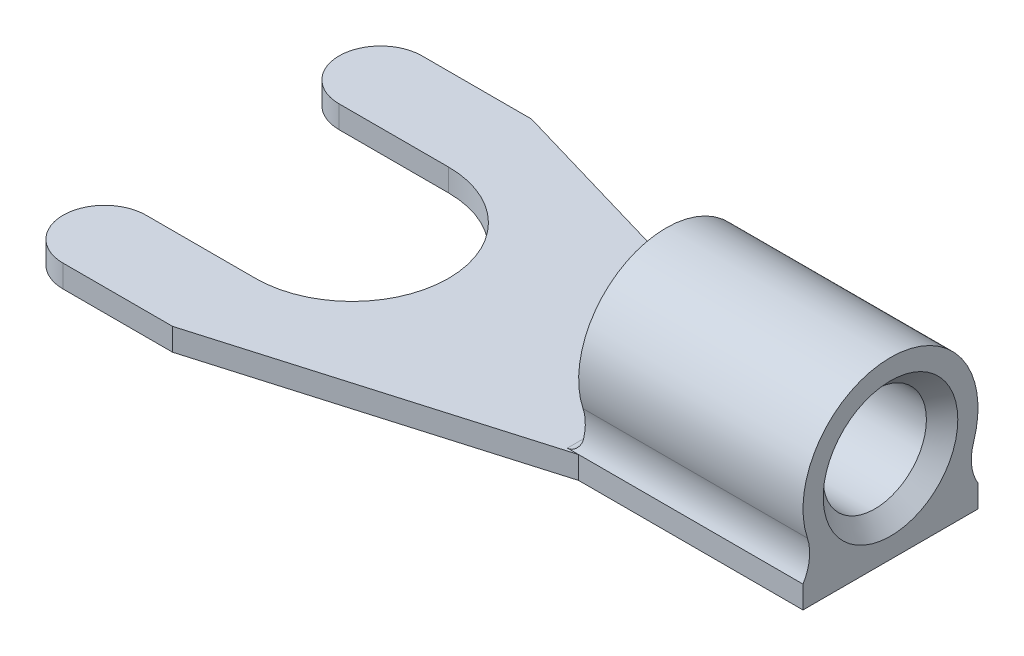
ISO-10303-21;
HEADER;
FILE_DESCRIPTION(('STEP AP214'),'2;1');
FILE_NAME('part.step','',(''),(''),'','','');
FILE_SCHEMA(('AUTOMOTIVE_DESIGN { 1 0 10303 214 1 1 1 1 }'));
ENDSEC;
DATA;
#1=APPLICATION_CONTEXT('core data for automotive mechanical design processes');
#2=APPLICATION_PROTOCOL_DEFINITION('international standard','automotive_design',2000,#1);
#3=PRODUCT_CONTEXT('',#1,'mechanical');
#4=PRODUCT('Part','Part','',(#3));
#5=PRODUCT_RELATED_PRODUCT_CATEGORY('part','',(#4));
#6=PRODUCT_DEFINITION_FORMATION('','',#4);
#7=PRODUCT_DEFINITION_CONTEXT('part definition',#1,'design');
#8=PRODUCT_DEFINITION('design','',#6,#7);
#9=PRODUCT_DEFINITION_SHAPE('','',#8);
#10=(LENGTH_UNIT() NAMED_UNIT(*) SI_UNIT(.MILLI.,.METRE.));
#11=(NAMED_UNIT(*) PLANE_ANGLE_UNIT() SI_UNIT($,.RADIAN.));
#12=(NAMED_UNIT(*) SI_UNIT($,.STERADIAN.) SOLID_ANGLE_UNIT());
#13=UNCERTAINTY_MEASURE_WITH_UNIT(LENGTH_MEASURE(1.E-05),#10,'distance_accuracy_value','');
#14=(GEOMETRIC_REPRESENTATION_CONTEXT(3) GLOBAL_UNCERTAINTY_ASSIGNED_CONTEXT((#13)) GLOBAL_UNIT_ASSIGNED_CONTEXT((#10,
#11,#12)) REPRESENTATION_CONTEXT('',''));
#15=CARTESIAN_POINT('',(0.,0.,0.));
#16=DIRECTION('',(0.,0.,1.));
#17=DIRECTION('',(1.,0.,0.));
#18=AXIS2_PLACEMENT_3D('',#15,#16,#17);
#19=CARTESIAN_POINT('',(6.75,0.75,0.));
#20=DIRECTION('',(0.,0.,-1.));
#21=DIRECTION('',(-1.,0.,0.));
#22=AXIS2_PLACEMENT_3D('',#19,#20,#21);
#23=CYLINDRICAL_SURFACE('',#22,0.25);
#24=DIRECTION('',(0.,0.,-1.));
#25=VECTOR('',#24,1.);
#26=CARTESIAN_POINT('',(7.,0.75,0.));
#27=LINE('',#26,#25);
#28=CARTESIAN_POINT('',(7.,0.75,1.83970172769144));
#29=VERTEX_POINT('',#28);
#30=CARTESIAN_POINT('',(7.,0.75,-1.83970172769145));
#31=VERTEX_POINT('',#30);
#32=EDGE_CURVE('E135',#29,#31,#27,.T.);
#33=ORIENTED_EDGE('',*,*,#32,.T.);
#34=CARTESIAN_POINT('',(6.75,0.5,-1.95));
#35=CARTESIAN_POINT('',(6.76279265219974,0.49998350208187,-1.95001852201698));
#36=CARTESIAN_POINT('',(6.7755633057261,0.500980599796446,-1.94939519772531));
#37=CARTESIAN_POINT('',(6.80063546863913,0.504859731445587,-1.94701727306771));
#38=CARTESIAN_POINT('',(6.81293922839229,0.507731040580708,-1.94526911017123));
#39=CARTESIAN_POINT('',(6.83678560324556,0.515212911902467,-1.94079455531296));
#40=CARTESIAN_POINT('',(6.84832945788207,0.519820554876355,-1.93806980561242));
#41=CARTESIAN_POINT('',(6.870457868658,0.530588402063698,-1.9318583154222));
#42=CARTESIAN_POINT('',(6.88104113706603,0.536750649720279,-1.92837057282786));
#43=CARTESIAN_POINT('',(6.90182686819083,0.550955109626043,-1.92057204094232));
#44=CARTESIAN_POINT('',(6.91194019338923,0.559104161345929,-1.91621898373589));
#45=CARTESIAN_POINT('',(6.93070840237227,0.576764076820902,-1.90714700315842));
#46=CARTESIAN_POINT('',(6.93936258007138,0.586275595783677,-1.90242790426221));
#47=CARTESIAN_POINT('',(6.95610042568564,0.607764133345738,-1.89223760604453));
#48=CARTESIAN_POINT('',(6.96396839551215,0.619900907889746,-1.88674760040437));
#49=CARTESIAN_POINT('',(6.97751486064914,0.645381102194384,-1.87588282433389));
#50=CARTESIAN_POINT('',(6.98319426201095,0.65872401979007,-1.87050800708861));
#51=CARTESIAN_POINT('',(6.99171759524682,0.684875563743601,-1.86066348131627));
#52=CARTESIAN_POINT('',(6.99479581212117,0.697594317014776,-1.85615788313342));
#53=CARTESIAN_POINT('',(6.99894022470101,0.723508733763793,-1.84757298169228));
#54=CARTESIAN_POINT('',(7.00000420944867,0.736704905121006,-1.84349415151592));
#55=CARTESIAN_POINT('',(7.,0.75,-1.83970172769145));
#56=B_SPLINE_CURVE_WITH_KNOTS('',3,(#34,#35,#36,#37,#38,#39,#40,#41,#42,#43,#44,#45,#46,#47,#48,
#49,#50,#51,#52,#53,#54,#55),.UNSPECIFIED.,.F.,.F.,(4,2,2,2,2,2,2,2,2,2,4),(0.,
0.0382893069018886,0.0763614093332972,0.114369786533511,0.152428386377301,0.193361552979276,
0.234314470757137,0.280522325949254,0.326711030823096,0.368073046255097,0.409480437175454),.UNSPECIFIED.);
#57=CARTESIAN_POINT('',(6.75,0.5,-1.95));
#58=VERTEX_POINT('',#57);
#59=EDGE_CURVE('E20',#58,#31,#56,.T.);
#60=ORIENTED_EDGE('',*,*,#59,.F.);
#61=DIRECTION('',(0.,0.,1.));
#62=VECTOR('',#61,1.);
#63=CARTESIAN_POINT('',(6.75,0.5,0.));
#64=LINE('',#63,#62);
#65=CARTESIAN_POINT('',(6.75,0.5,1.95));
#66=VERTEX_POINT('',#65);
#67=EDGE_CURVE('E132',#66,#58,#64,.F.);
#68=ORIENTED_EDGE('',*,*,#67,.F.);
#69=CARTESIAN_POINT('',(7.,0.75,1.83970172769144));
#70=CARTESIAN_POINT('',(7.000006521075,0.735127796790294,1.84394032011878));
#71=CARTESIAN_POINT('',(6.99867427441531,0.720382659943751,1.84854137054598));
#72=CARTESIAN_POINT('',(6.99350891013348,0.691550767285415,1.8582501300237));
#73=CARTESIAN_POINT('',(6.98968232860374,0.677462393603863,1.86335648540662));
#74=CARTESIAN_POINT('',(6.97970942661208,0.650283784135015,1.87387530595083));
#75=CARTESIAN_POINT('',(6.97356600432858,0.637192325778406,1.87928738151938));
#76=CARTESIAN_POINT('',(6.95913179602968,0.612263039792255,1.89017218669945));
#77=CARTESIAN_POINT('',(6.95083905655132,0.600426366468528,1.8956449671302));
#78=CARTESIAN_POINT('',(6.93190778527895,0.577851412965472,1.9065665800011));
#79=CARTESIAN_POINT('',(6.92118933448232,0.567175227082837,1.9120058737872));
#80=CARTESIAN_POINT('',(6.89781213081132,0.547807805392044,1.92224466813309));
#81=CARTESIAN_POINT('',(6.88515348283173,0.539116462338589,1.92704420325457));
#82=CARTESIAN_POINT('',(6.85882494158289,0.524449038300311,1.93536105133942));
#83=CARTESIAN_POINT('',(6.84523320827134,0.518362266308088,1.93892902019162));
#84=CARTESIAN_POINT('',(6.81693782547046,0.508667793434214,1.9446966990955));
#85=CARTESIAN_POINT('',(6.80223768054368,0.505052615028265,1.94690053424634));
#86=CARTESIAN_POINT('',(6.78112626789295,0.501866510936535,1.94885133002611));
#87=CARTESIAN_POINT('',(6.7749289859734,0.501167615441771,1.94928088909551));
#88=CARTESIAN_POINT('',(6.76248923138757,0.500234473310872,1.94985533198226));
#89=CARTESIAN_POINT('',(6.75624677974096,0.500000022951555,1.95000034061393));
#90=CARTESIAN_POINT('',(6.75,0.5,1.95));
#91=B_SPLINE_CURVE_WITH_KNOTS('',3,(#69,#70,#71,#72,#73,#74,#75,#76,#77,#78,#79,#80,#81,#82,#83,
#84,#85,#86,#87,#88,#89,#90),.UNSPECIFIED.,.F.,.F.,(4,2,2,2,2,2,2,2,2,2,4),(0.,
0.0462989373863092,0.0924770392758406,0.138597566715203,0.18476015989697,0.232751610935631,
0.280740468279867,0.326416072227268,0.371952870974995,0.390686940772955,0.409412791278968),.UNSPECIFIED.);
#92=EDGE_CURVE('E140',#29,#66,#91,.T.);
#93=ORIENTED_EDGE('',*,*,#92,.F.);
#94=EDGE_LOOP('',(#33,#60,#68,#93));
#95=FACE_BOUND('',#94,.T.);
#96=ADVANCED_FACE('F16',(#95),#23,.F.);
#97=CARTESIAN_POINT('',(7.,1.95,0.));
#98=DIRECTION('',(1.,0.,0.));
#99=DIRECTION('',(0.,0.,-1.));
#100=AXIS2_PLACEMENT_3D('',#97,#98,#99);
#101=CYLINDRICAL_SURFACE('',#100,1.15);
#102=CARTESIAN_POINT('',(11.6499999999746,1.95,0.));
#103=DIRECTION('',(1.,0.,0.));
#104=DIRECTION('',(0.,0.,-1.));
#105=AXIS2_PLACEMENT_3D('',#102,#103,#104);
#106=CIRCLE('',#105,1.14999999999554);
#107=CARTESIAN_POINT('',(11.6499999999746,1.95,-1.14999999999554));
#108=VERTEX_POINT('',#107);
#109=EDGE_CURVE('E224',#108,#108,#106,.T.);
#110=ORIENTED_EDGE('',*,*,#109,.T.);
#111=EDGE_LOOP('',(#110));
#112=FACE_BOUND('',#111,.T.);
#113=CARTESIAN_POINT('',(7.,1.95,0.));
#114=DIRECTION('',(1.,0.,0.));
#115=DIRECTION('',(0.,0.,-1.));
#116=AXIS2_PLACEMENT_3D('',#113,#114,#115);
#117=CIRCLE('',#116,1.15);
#118=CARTESIAN_POINT('',(7.,1.95,-1.15));
#119=VERTEX_POINT('',#118);
#120=EDGE_CURVE('E150',#119,#119,#117,.F.);
#121=ORIENTED_EDGE('',*,*,#120,.T.);
#122=EDGE_LOOP('',(#121));
#123=FACE_BOUND('',#122,.T.);
#124=ADVANCED_FACE('F277',(#112,#123),#101,.F.);
#125=CARTESIAN_POINT('',(7.,1.95,0.));
#126=DIRECTION('',(1.,0.,0.));
#127=DIRECTION('',(0.,0.,-1.));
#128=AXIS2_PLACEMENT_3D('',#125,#126,#127);
#129=PLANE('',#128);
#130=ORIENTED_EDGE('',*,*,#120,.F.);
#131=EDGE_LOOP('',(#130));
#132=FACE_BOUND('',#131,.T.);
#133=ORIENTED_EDGE('',*,*,#32,.F.);
#134=CARTESIAN_POINT('',(7.,1.02486780796408,2.80118375463996));
#135=DIRECTION('',(-1.,0.,0.));
#136=DIRECTION('',(0.,0.,1.));
#137=AXIS2_PLACEMENT_3D('',#134,#135,#136);
#138=CIRCLE('',#137,1.);
#139=CARTESIAN_POINT('',(7.,1.33847194085761,1.85162993950777));
#140=VERTEX_POINT('',#139);
#141=EDGE_CURVE('E191',#29,#140,#138,.F.);
#142=ORIENTED_EDGE('',*,*,#141,.T.);
#143=CARTESIAN_POINT('',(7.,1.95,0.));
#144=DIRECTION('',(1.,0.,0.));
#145=DIRECTION('',(0.,0.,-1.));
#146=AXIS2_PLACEMENT_3D('',#143,#144,#145);
#147=CIRCLE('',#146,1.95);
#148=CARTESIAN_POINT('',(7.,1.33847194085761,-1.85162993950777));
#149=VERTEX_POINT('',#148);
#150=EDGE_CURVE('E161',#149,#140,#147,.T.);
#151=ORIENTED_EDGE('',*,*,#150,.F.);
#152=CARTESIAN_POINT('',(7.,1.02486780796408,-2.80118375463996));
#153=DIRECTION('',(1.,0.,0.));
#154=DIRECTION('',(0.,0.,-1.));
#155=AXIS2_PLACEMENT_3D('',#152,#153,#154);
#156=CIRCLE('',#155,1.);
#157=EDGE_CURVE('E223',#31,#149,#156,.F.);
#158=ORIENTED_EDGE('',*,*,#157,.F.);
#159=EDGE_LOOP('',(#133,#142,#151,#158));
#160=FACE_BOUND('',#159,.T.);
#161=ADVANCED_FACE('F275',(#132,#160),#129,.F.);
#162=CARTESIAN_POINT('',(0.,0.5,0.));
#163=DIRECTION('',(0.,1.,0.));
#164=DIRECTION('',(0.,0.,1.));
#165=AXIS2_PLACEMENT_3D('',#162,#163,#164);
#166=PLANE('',#165);
#167=DIRECTION('',(-0.959692321040619,0.,0.281052751161895));
#168=VECTOR('',#167,1.);
#169=CARTESIAN_POINT('',(1.07889666838964,0.5,3.68403740425732));
#170=LINE('',#169,#168);
#171=CARTESIAN_POINT('',(0.,0.5,4.));
#172=VERTEX_POINT('',#171);
#173=CARTESIAN_POINT('',(7.,0.5,1.95));
#174=VERTEX_POINT('',#173);
#175=EDGE_CURVE('E197',#172,#174,#170,.F.);
#176=ORIENTED_EDGE('',*,*,#175,.T.);
#177=DIRECTION('',(-1.,0.,0.));
#178=VECTOR('',#177,1.);
#179=CARTESIAN_POINT('',(0.,0.499999999999999,1.95));
#180=LINE('',#179,#178);
#181=EDGE_CURVE('E148',#174,#66,#180,.T.);
#182=ORIENTED_EDGE('',*,*,#181,.T.);
#183=ORIENTED_EDGE('',*,*,#67,.T.);
#184=DIRECTION('',(1.,0.,0.));
#185=VECTOR('',#184,1.);
#186=CARTESIAN_POINT('',(0.,0.5,-1.95));
#187=LINE('',#186,#185);
#188=CARTESIAN_POINT('',(7.,0.5,-1.95));
#189=VERTEX_POINT('',#188);
#190=EDGE_CURVE('E146',#58,#189,#187,.T.);
#191=ORIENTED_EDGE('',*,*,#190,.T.);
#192=DIRECTION('',(0.959692321040619,0.,0.281052751161895));
#193=VECTOR('',#192,1.);
#194=CARTESIAN_POINT('',(1.07889666838964,0.5,-3.68403740425732));
#195=LINE('',#194,#193);
#196=CARTESIAN_POINT('',(0.,0.5,-4.));
#197=VERTEX_POINT('',#196);
#198=EDGE_CURVE('E155',#189,#197,#195,.F.);
#199=ORIENTED_EDGE('',*,*,#198,.T.);
#200=DIRECTION('',(-1.,0.,0.));
#201=VECTOR('',#200,1.);
#202=CARTESIAN_POINT('',(0.,0.5,-4.));
#203=LINE('',#202,#201);
#204=CARTESIAN_POINT('',(-2.43926218353009,0.5,-4.));
#205=VERTEX_POINT('',#204);
#206=EDGE_CURVE('E158',#205,#197,#203,.F.);
#207=ORIENTED_EDGE('',*,*,#206,.F.);
#208=CARTESIAN_POINT('',(-2.43926218353009,0.5,-3.075));
#209=DIRECTION('',(0.,-1.,0.));
#210=DIRECTION('',(0.,0.,-1.));
#211=AXIS2_PLACEMENT_3D('',#208,#209,#210);
#212=CIRCLE('',#211,0.925);
#213=CARTESIAN_POINT('',(-2.43926218353009,0.5,-2.15));
#214=VERTEX_POINT('',#213);
#215=EDGE_CURVE('E253',#214,#205,#212,.T.);
#216=ORIENTED_EDGE('',*,*,#215,.F.);
#217=DIRECTION('',(1.,0.,0.));
#218=VECTOR('',#217,1.);
#219=CARTESIAN_POINT('',(0.,0.5,-2.15));
#220=LINE('',#219,#218);
#221=CARTESIAN_POINT('',(0.,0.5,-2.15));
#222=VERTEX_POINT('',#221);
#223=EDGE_CURVE('E214',#222,#214,#220,.F.);
#224=ORIENTED_EDGE('',*,*,#223,.F.);
#225=CARTESIAN_POINT('',(0.,0.5,0.));
#226=DIRECTION('',(0.,-1.,0.));
#227=DIRECTION('',(0.,0.,-1.));
#228=AXIS2_PLACEMENT_3D('',#225,#226,#227);
#229=CIRCLE('',#228,2.15);
#230=CARTESIAN_POINT('',(0.,0.5,2.15));
#231=VERTEX_POINT('',#230);
#232=EDGE_CURVE('E250',#222,#231,#229,.T.);
#233=ORIENTED_EDGE('',*,*,#232,.T.);
#234=DIRECTION('',(1.,0.,0.));
#235=VECTOR('',#234,1.);
#236=CARTESIAN_POINT('',(0.,0.5,2.15));
#237=LINE('',#236,#235);
#238=CARTESIAN_POINT('',(-2.43926218353009,0.5,2.15));
#239=VERTEX_POINT('',#238);
#240=EDGE_CURVE('E209',#231,#239,#237,.F.);
#241=ORIENTED_EDGE('',*,*,#240,.T.);
#242=CARTESIAN_POINT('',(-2.43926218353009,0.5,3.075));
#243=DIRECTION('',(0.,-1.,0.));
#244=DIRECTION('',(0.,0.,-1.));
#245=AXIS2_PLACEMENT_3D('',#242,#243,#244);
#246=CIRCLE('',#245,0.925);
#247=CARTESIAN_POINT('',(-2.43926218353009,0.5,4.));
#248=VERTEX_POINT('',#247);
#249=EDGE_CURVE('E212',#248,#239,#246,.T.);
#250=ORIENTED_EDGE('',*,*,#249,.F.);
#251=DIRECTION('',(-1.,0.,0.));
#252=VECTOR('',#251,1.);
#253=CARTESIAN_POINT('',(0.,0.5,4.));
#254=LINE('',#253,#252);
#255=EDGE_CURVE('E204',#248,#172,#254,.F.);
#256=ORIENTED_EDGE('',*,*,#255,.T.);
#257=EDGE_LOOP('',(#176,#182,#183,#191,#199,#207,#216,#224,#233,#241,#250,#256));
#258=FACE_BOUND('',#257,.T.);
#259=ADVANCED_FACE('F144',(#258),#166,.T.);
#260=CARTESIAN_POINT('',(0.,1.02486780796408,2.80118375463996));
#261=DIRECTION('',(-1.,0.,0.));
#262=DIRECTION('',(0.,0.,1.));
#263=AXIS2_PLACEMENT_3D('',#260,#261,#262);
#264=CYLINDRICAL_SURFACE('',#263,1.);
#265=ORIENTED_EDGE('',*,*,#92,.T.);
#266=ORIENTED_EDGE('',*,*,#181,.F.);
#267=DIRECTION('',(-1.,0.,0.));
#268=VECTOR('',#267,1.);
#269=CARTESIAN_POINT('',(0.,0.5,1.95));
#270=LINE('',#269,#268);
#271=CARTESIAN_POINT('',(12.,0.499999999999997,1.95));
#272=VERTEX_POINT('',#271);
#273=EDGE_CURVE('E178',#174,#272,#270,.F.);
#274=ORIENTED_EDGE('',*,*,#273,.T.);
#275=CARTESIAN_POINT('',(12.,1.02486780796408,2.80118375463996));
#276=DIRECTION('',(-1.,0.,0.));
#277=DIRECTION('',(0.,0.,1.));
#278=AXIS2_PLACEMENT_3D('',#275,#276,#277);
#279=CIRCLE('',#278,1.);
#280=CARTESIAN_POINT('',(12.,1.33847194085761,1.85162993950777));
#281=VERTEX_POINT('',#280);
#282=EDGE_CURVE('E192',#281,#272,#279,.T.);
#283=ORIENTED_EDGE('',*,*,#282,.F.);
#284=DIRECTION('',(-1.,0.,0.));
#285=VECTOR('',#284,1.);
#286=CARTESIAN_POINT('',(0.,1.33847194085761,1.85162993950777));
#287=LINE('',#286,#285);
#288=EDGE_CURVE('E149',#140,#281,#287,.F.);
#289=ORIENTED_EDGE('',*,*,#288,.F.);
#290=ORIENTED_EDGE('',*,*,#141,.F.);
#291=EDGE_LOOP('',(#265,#266,#274,#283,#289,#290));
#292=FACE_BOUND('',#291,.T.);
#293=ADVANCED_FACE('F265',(#292),#264,.F.);
#294=CARTESIAN_POINT('',(11.9999999999436,1.95,0.));
#295=DIRECTION('',(1.,0.,0.));
#296=DIRECTION('',(0.,0.,-1.));
#297=AXIS2_PLACEMENT_3D('',#294,#295,#296);
#298=CONICAL_SURFACE('',#297,1.49999999996453,0.785398163397448);
#299=CARTESIAN_POINT('',(12.0000000000005,1.95,0.));
#300=DIRECTION('',(1.,0.,0.));
#301=DIRECTION('',(0.,0.,-1.));
#302=AXIS2_PLACEMENT_3D('',#299,#300,#301);
#303=CIRCLE('',#302,1.50000000002137);
#304=CARTESIAN_POINT('',(12.0000000000005,1.95,-1.50000000002137));
#305=VERTEX_POINT('',#304);
#306=EDGE_CURVE('E181',#305,#305,#303,.T.);
#307=ORIENTED_EDGE('',*,*,#306,.T.);
#308=EDGE_LOOP('',(#307));
#309=FACE_BOUND('',#308,.T.);
#310=ORIENTED_EDGE('',*,*,#109,.F.);
#311=EDGE_LOOP('',(#310));
#312=FACE_BOUND('',#311,.T.);
#313=ADVANCED_FACE('F270',(#309,#312),#298,.F.);
#314=CARTESIAN_POINT('',(7.,1.95,0.));
#315=DIRECTION('',(1.,0.,0.));
#316=DIRECTION('',(0.,0.,-1.));
#317=AXIS2_PLACEMENT_3D('',#314,#315,#316);
#318=CYLINDRICAL_SURFACE('',#317,1.95);
#319=CARTESIAN_POINT('',(12.,1.95,0.));
#320=DIRECTION('',(1.,0.,0.));
#321=DIRECTION('',(0.,0.,-1.));
#322=AXIS2_PLACEMENT_3D('',#319,#320,#321);
#323=CIRCLE('',#322,1.95);
#324=CARTESIAN_POINT('',(12.,1.33847194085761,-1.85162993950777));
#325=VERTEX_POINT('',#324);
#326=EDGE_CURVE('E243',#281,#325,#323,.F.);
#327=ORIENTED_EDGE('',*,*,#326,.T.);
#328=DIRECTION('',(1.,0.,0.));
#329=VECTOR('',#328,1.);
#330=CARTESIAN_POINT('',(0.,1.33847194085761,-1.85162993950777));
#331=LINE('',#330,#329);
#332=EDGE_CURVE('E156',#325,#149,#331,.F.);
#333=ORIENTED_EDGE('',*,*,#332,.T.);
#334=ORIENTED_EDGE('',*,*,#150,.T.);
#335=ORIENTED_EDGE('',*,*,#288,.T.);
#336=EDGE_LOOP('',(#327,#333,#334,#335));
#337=FACE_BOUND('',#336,.T.);
#338=ADVANCED_FACE('F342',(#337),#318,.T.);
#339=CARTESIAN_POINT('',(0.,1.02486780796408,-2.80118375463996));
#340=DIRECTION('',(1.,0.,0.));
#341=DIRECTION('',(0.,0.,-1.));
#342=AXIS2_PLACEMENT_3D('',#339,#340,#341);
#343=CYLINDRICAL_SURFACE('',#342,1.);
#344=DIRECTION('',(1.,0.,0.));
#345=VECTOR('',#344,1.);
#346=CARTESIAN_POINT('',(0.,0.5,-1.95));
#347=LINE('',#346,#345);
#348=CARTESIAN_POINT('',(12.,0.499999999999999,-1.95));
#349=VERTEX_POINT('',#348);
#350=EDGE_CURVE('E154',#349,#189,#347,.F.);
#351=ORIENTED_EDGE('',*,*,#350,.T.);
#352=ORIENTED_EDGE('',*,*,#190,.F.);
#353=ORIENTED_EDGE('',*,*,#59,.T.);
#354=ORIENTED_EDGE('',*,*,#157,.T.);
#355=ORIENTED_EDGE('',*,*,#332,.F.);
#356=CARTESIAN_POINT('',(12.,1.02486780796408,-2.80118375463996));
#357=DIRECTION('',(1.,0.,0.));
#358=DIRECTION('',(0.,0.,-1.));
#359=AXIS2_PLACEMENT_3D('',#356,#357,#358);
#360=CIRCLE('',#359,1.);
#361=EDGE_CURVE('E170',#325,#349,#360,.T.);
#362=ORIENTED_EDGE('',*,*,#361,.T.);
#363=EDGE_LOOP('',(#351,#352,#353,#354,#355,#362));
#364=FACE_BOUND('',#363,.T.);
#365=ADVANCED_FACE('F153',(#364),#343,.F.);
#366=CARTESIAN_POINT('',(1.07889666838964,0.5,-3.68403740425732));
#367=DIRECTION('',(-0.281052751161895,0.,0.959692321040619));
#368=DIRECTION('',(0.959692321040619,0.,0.281052751161895));
#369=AXIS2_PLACEMENT_3D('',#366,#367,#368);
#370=PLANE('',#369);
#371=DIRECTION('',(0.,1.,0.));
#372=VECTOR('',#371,1.);
#373=CARTESIAN_POINT('',(0.,0.5,-4.));
#374=LINE('',#373,#372);
#375=CARTESIAN_POINT('',(0.,0.,-4.));
#376=VERTEX_POINT('',#375);
#377=EDGE_CURVE('E219',#197,#376,#374,.F.);
#378=ORIENTED_EDGE('',*,*,#377,.F.);
#379=ORIENTED_EDGE('',*,*,#198,.F.);
#380=DIRECTION('',(0.,1.,0.));
#381=VECTOR('',#380,1.);
#382=CARTESIAN_POINT('',(7.,0.5,-1.95));
#383=LINE('',#382,#381);
#384=CARTESIAN_POINT('',(7.,0.,-1.95));
#385=VERTEX_POINT('',#384);
#386=EDGE_CURVE('E387',#189,#385,#383,.F.);
#387=ORIENTED_EDGE('',*,*,#386,.T.);
#388=DIRECTION('',(-0.959692321040619,0.,-0.281052751161895));
#389=VECTOR('',#388,1.);
#390=CARTESIAN_POINT('',(7.,0.,-1.95));
#391=LINE('',#390,#389);
#392=EDGE_CURVE('E384',#385,#376,#391,.T.);
#393=ORIENTED_EDGE('',*,*,#392,.T.);
#394=EDGE_LOOP('',(#378,#379,#387,#393));
#395=FACE_BOUND('',#394,.T.);
#396=ADVANCED_FACE('F336',(#395),#370,.F.);
#397=CARTESIAN_POINT('',(0.,0.5,-4.));
#398=DIRECTION('',(0.,0.,-1.));
#399=DIRECTION('',(-1.,0.,0.));
#400=AXIS2_PLACEMENT_3D('',#397,#398,#399);
#401=PLANE('',#400);
#402=ORIENTED_EDGE('',*,*,#206,.T.);
#403=ORIENTED_EDGE('',*,*,#377,.T.);
#404=DIRECTION('',(1.,0.,0.));
#405=VECTOR('',#404,1.);
#406=CARTESIAN_POINT('',(0.,0.,-4.));
#407=LINE('',#406,#405);
#408=CARTESIAN_POINT('',(-2.43926218353009,0.,-4.));
#409=VERTEX_POINT('',#408);
#410=EDGE_CURVE('E241',#376,#409,#407,.F.);
#411=ORIENTED_EDGE('',*,*,#410,.T.);
#412=DIRECTION('',(0.,-1.,0.));
#413=VECTOR('',#412,1.);
#414=CARTESIAN_POINT('',(-2.43926218353009,0.5,-4.));
#415=LINE('',#414,#413);
#416=EDGE_CURVE('E217',#205,#409,#415,.T.);
#417=ORIENTED_EDGE('',*,*,#416,.F.);
#418=EDGE_LOOP('',(#402,#403,#411,#417));
#419=FACE_BOUND('',#418,.T.);
#420=ADVANCED_FACE('F332',(#419),#401,.T.);
#421=CARTESIAN_POINT('',(-2.43926218353009,0.5,-3.075));
#422=DIRECTION('',(0.,-1.,0.));
#423=DIRECTION('',(0.,0.,-1.));
#424=AXIS2_PLACEMENT_3D('',#421,#422,#423);
#425=CYLINDRICAL_SURFACE('',#424,0.925);
#426=ORIENTED_EDGE('',*,*,#215,.T.);
#427=ORIENTED_EDGE('',*,*,#416,.T.);
#428=CARTESIAN_POINT('',(-2.43926218353009,0.,-3.075));
#429=DIRECTION('',(0.,-1.,0.));
#430=DIRECTION('',(0.,0.,-1.));
#431=AXIS2_PLACEMENT_3D('',#428,#429,#430);
#432=CIRCLE('',#431,0.925);
#433=CARTESIAN_POINT('',(-2.43926218353009,0.,-2.15));
#434=VERTEX_POINT('',#433);
#435=EDGE_CURVE('E238',#409,#434,#432,.F.);
#436=ORIENTED_EDGE('',*,*,#435,.T.);
#437=DIRECTION('',(0.,1.,0.));
#438=VECTOR('',#437,1.);
#439=CARTESIAN_POINT('',(-2.43926218353009,0.5,-2.15));
#440=LINE('',#439,#438);
#441=EDGE_CURVE('E216',#214,#434,#440,.F.);
#442=ORIENTED_EDGE('',*,*,#441,.F.);
#443=EDGE_LOOP('',(#426,#427,#436,#442));
#444=FACE_BOUND('',#443,.T.);
#445=ADVANCED_FACE('F328',(#444),#425,.T.);
#446=CARTESIAN_POINT('',(0.,0.5,-2.15));
#447=DIRECTION('',(0.,0.,1.));
#448=DIRECTION('',(1.,0.,0.));
#449=AXIS2_PLACEMENT_3D('',#446,#447,#448);
#450=PLANE('',#449);
#451=ORIENTED_EDGE('',*,*,#223,.T.);
#452=ORIENTED_EDGE('',*,*,#441,.T.);
#453=DIRECTION('',(1.,0.,0.));
#454=VECTOR('',#453,1.);
#455=CARTESIAN_POINT('',(0.,0.,-2.15));
#456=LINE('',#455,#454);
#457=CARTESIAN_POINT('',(0.,0.,-2.15));
#458=VERTEX_POINT('',#457);
#459=EDGE_CURVE('E237',#434,#458,#456,.T.);
#460=ORIENTED_EDGE('',*,*,#459,.T.);
#461=DIRECTION('',(0.,-1.,0.));
#462=VECTOR('',#461,1.);
#463=CARTESIAN_POINT('',(0.,0.5,-2.15));
#464=LINE('',#463,#462);
#465=EDGE_CURVE('E252',#458,#222,#464,.F.);
#466=ORIENTED_EDGE('',*,*,#465,.T.);
#467=EDGE_LOOP('',(#451,#452,#460,#466));
#468=FACE_BOUND('',#467,.T.);
#469=ADVANCED_FACE('F324',(#468),#450,.T.);
#470=CARTESIAN_POINT('',(0.,0.5,0.));
#471=DIRECTION('',(0.,-1.,0.));
#472=DIRECTION('',(0.,0.,-1.));
#473=AXIS2_PLACEMENT_3D('',#470,#471,#472);
#474=CYLINDRICAL_SURFACE('',#473,2.15);
#475=DIRECTION('',(0.,1.,0.));
#476=VECTOR('',#475,1.);
#477=CARTESIAN_POINT('',(0.,0.5,2.15));
#478=LINE('',#477,#476);
#479=CARTESIAN_POINT('',(0.,0.,2.15));
#480=VERTEX_POINT('',#479);
#481=EDGE_CURVE('E213',#480,#231,#478,.T.);
#482=ORIENTED_EDGE('',*,*,#481,.T.);
#483=ORIENTED_EDGE('',*,*,#232,.F.);
#484=ORIENTED_EDGE('',*,*,#465,.F.);
#485=CARTESIAN_POINT('',(0.,0.,0.));
#486=DIRECTION('',(0.,-1.,0.));
#487=DIRECTION('',(0.,0.,-1.));
#488=AXIS2_PLACEMENT_3D('',#485,#486,#487);
#489=CIRCLE('',#488,2.15);
#490=EDGE_CURVE('E234',#458,#480,#489,.T.);
#491=ORIENTED_EDGE('',*,*,#490,.T.);
#492=EDGE_LOOP('',(#482,#483,#484,#491));
#493=FACE_BOUND('',#492,.T.);
#494=ADVANCED_FACE('F320',(#493),#474,.F.);
#495=CARTESIAN_POINT('',(0.,0.5,2.15));
#496=DIRECTION('',(0.,0.,1.));
#497=DIRECTION('',(1.,0.,0.));
#498=AXIS2_PLACEMENT_3D('',#495,#496,#497);
#499=PLANE('',#498);
#500=DIRECTION('',(0.,-1.,0.));
#501=VECTOR('',#500,1.);
#502=CARTESIAN_POINT('',(-2.43926218353009,0.5,2.15));
#503=LINE('',#502,#501);
#504=CARTESIAN_POINT('',(-2.43926218353009,0.,2.15));
#505=VERTEX_POINT('',#504);
#506=EDGE_CURVE('E249',#239,#505,#503,.T.);
#507=ORIENTED_EDGE('',*,*,#506,.F.);
#508=ORIENTED_EDGE('',*,*,#240,.F.);
#509=ORIENTED_EDGE('',*,*,#481,.F.);
#510=DIRECTION('',(1.,0.,0.));
#511=VECTOR('',#510,1.);
#512=CARTESIAN_POINT('',(0.,0.,2.15));
#513=LINE('',#512,#511);
#514=EDGE_CURVE('E233',#480,#505,#513,.F.);
#515=ORIENTED_EDGE('',*,*,#514,.T.);
#516=EDGE_LOOP('',(#507,#508,#509,#515));
#517=FACE_BOUND('',#516,.T.);
#518=ADVANCED_FACE('F316',(#517),#499,.F.);
#519=CARTESIAN_POINT('',(-2.43926218353009,0.5,3.075));
#520=DIRECTION('',(0.,-1.,0.));
#521=DIRECTION('',(0.,0.,-1.));
#522=AXIS2_PLACEMENT_3D('',#519,#520,#521);
#523=CYLINDRICAL_SURFACE('',#522,0.925);
#524=ORIENTED_EDGE('',*,*,#249,.T.);
#525=ORIENTED_EDGE('',*,*,#506,.T.);
#526=CARTESIAN_POINT('',(-2.43926218353009,0.,3.075));
#527=DIRECTION('',(0.,-1.,0.));
#528=DIRECTION('',(0.,0.,-1.));
#529=AXIS2_PLACEMENT_3D('',#526,#527,#528);
#530=CIRCLE('',#529,0.925);
#531=CARTESIAN_POINT('',(-2.43926218353009,0.,4.));
#532=VERTEX_POINT('',#531);
#533=EDGE_CURVE('E229',#505,#532,#530,.F.);
#534=ORIENTED_EDGE('',*,*,#533,.T.);
#535=DIRECTION('',(0.,1.,0.));
#536=VECTOR('',#535,1.);
#537=CARTESIAN_POINT('',(-2.43926218353009,0.5,4.));
#538=LINE('',#537,#536);
#539=EDGE_CURVE('E206',#532,#248,#538,.T.);
#540=ORIENTED_EDGE('',*,*,#539,.T.);
#541=EDGE_LOOP('',(#524,#525,#534,#540));
#542=FACE_BOUND('',#541,.T.);
#543=ADVANCED_FACE('F312',(#542),#523,.T.);
#544=CARTESIAN_POINT('',(0.,0.5,4.));
#545=DIRECTION('',(0.,0.,-1.));
#546=DIRECTION('',(-1.,0.,0.));
#547=AXIS2_PLACEMENT_3D('',#544,#545,#546);
#548=PLANE('',#547);
#549=DIRECTION('',(0.,1.,0.));
#550=VECTOR('',#549,1.);
#551=CARTESIAN_POINT('',(0.,0.5,4.));
#552=LINE('',#551,#550);
#553=CARTESIAN_POINT('',(0.,0.,4.));
#554=VERTEX_POINT('',#553);
#555=EDGE_CURVE('E201',#554,#172,#552,.T.);
#556=ORIENTED_EDGE('',*,*,#555,.T.);
#557=ORIENTED_EDGE('',*,*,#255,.F.);
#558=ORIENTED_EDGE('',*,*,#539,.F.);
#559=DIRECTION('',(1.,0.,0.));
#560=VECTOR('',#559,1.);
#561=CARTESIAN_POINT('',(0.,0.,4.));
#562=LINE('',#561,#560);
#563=EDGE_CURVE('E232',#532,#554,#562,.T.);
#564=ORIENTED_EDGE('',*,*,#563,.T.);
#565=EDGE_LOOP('',(#556,#557,#558,#564));
#566=FACE_BOUND('',#565,.T.);
#567=ADVANCED_FACE('F308',(#566),#548,.F.);
#568=CARTESIAN_POINT('',(1.07889666838964,0.5,3.68403740425732));
#569=DIRECTION('',(-0.281052751161895,0.,-0.959692321040619));
#570=DIRECTION('',(-0.959692321040619,0.,0.281052751161895));
#571=AXIS2_PLACEMENT_3D('',#568,#569,#570);
#572=PLANE('',#571);
#573=DIRECTION('',(0.,1.,0.));
#574=VECTOR('',#573,1.);
#575=CARTESIAN_POINT('',(7.,0.5,1.95));
#576=LINE('',#575,#574);
#577=CARTESIAN_POINT('',(7.,0.,1.95));
#578=VERTEX_POINT('',#577);
#579=EDGE_CURVE('E182',#578,#174,#576,.T.);
#580=ORIENTED_EDGE('',*,*,#579,.T.);
#581=ORIENTED_EDGE('',*,*,#175,.F.);
#582=ORIENTED_EDGE('',*,*,#555,.F.);
#583=DIRECTION('',(0.959692321040619,0.,-0.281052751161895));
#584=VECTOR('',#583,1.);
#585=CARTESIAN_POINT('',(0.,0.,4.));
#586=LINE('',#585,#584);
#587=EDGE_CURVE('E187',#554,#578,#586,.T.);
#588=ORIENTED_EDGE('',*,*,#587,.T.);
#589=EDGE_LOOP('',(#580,#581,#582,#588));
#590=FACE_BOUND('',#589,.T.);
#591=ADVANCED_FACE('F304',(#590),#572,.F.);
#592=CARTESIAN_POINT('',(0.,0.5,1.95));
#593=DIRECTION('',(0.,0.,-1.));
#594=DIRECTION('',(-1.,0.,0.));
#595=AXIS2_PLACEMENT_3D('',#592,#593,#594);
#596=PLANE('',#595);
#597=DIRECTION('',(0.,1.,0.));
#598=VECTOR('',#597,1.);
#599=CARTESIAN_POINT('',(12.,0.5,1.95));
#600=LINE('',#599,#598);
#601=CARTESIAN_POINT('',(12.,0.,1.95));
#602=VERTEX_POINT('',#601);
#603=EDGE_CURVE('E245',#602,#272,#600,.T.);
#604=ORIENTED_EDGE('',*,*,#603,.T.);
#605=ORIENTED_EDGE('',*,*,#273,.F.);
#606=ORIENTED_EDGE('',*,*,#579,.F.);
#607=DIRECTION('',(1.,0.,0.));
#608=VECTOR('',#607,1.);
#609=CARTESIAN_POINT('',(0.,0.,1.95));
#610=LINE('',#609,#608);
#611=EDGE_CURVE('E175',#578,#602,#610,.T.);
#612=ORIENTED_EDGE('',*,*,#611,.T.);
#613=EDGE_LOOP('',(#604,#605,#606,#612));
#614=FACE_BOUND('',#613,.T.);
#615=ADVANCED_FACE('F300',(#614),#596,.F.);
#616=CARTESIAN_POINT('',(12.,0.5,0.));
#617=DIRECTION('',(-1.,0.,0.));
#618=DIRECTION('',(0.,0.,1.));
#619=AXIS2_PLACEMENT_3D('',#616,#617,#618);
#620=PLANE('',#619);
#621=DIRECTION('',(0.,1.,0.));
#622=VECTOR('',#621,1.);
#623=CARTESIAN_POINT('',(12.,0.5,-1.95));
#624=LINE('',#623,#622);
#625=CARTESIAN_POINT('',(12.,0.,-1.95));
#626=VERTEX_POINT('',#625);
#627=EDGE_CURVE('E38',#626,#349,#624,.T.);
#628=ORIENTED_EDGE('',*,*,#627,.T.);
#629=ORIENTED_EDGE('',*,*,#361,.F.);
#630=ORIENTED_EDGE('',*,*,#326,.F.);
#631=ORIENTED_EDGE('',*,*,#282,.T.);
#632=ORIENTED_EDGE('',*,*,#603,.F.);
#633=DIRECTION('',(0.,0.,1.));
#634=VECTOR('',#633,1.);
#635=CARTESIAN_POINT('',(12.,0.,0.));
#636=LINE('',#635,#634);
#637=EDGE_CURVE('E30',#602,#626,#636,.F.);
#638=ORIENTED_EDGE('',*,*,#637,.T.);
#639=EDGE_LOOP('',(#628,#629,#630,#631,#632,#638));
#640=FACE_BOUND('',#639,.T.);
#641=ORIENTED_EDGE('',*,*,#306,.F.);
#642=EDGE_LOOP('',(#641));
#643=FACE_BOUND('',#642,.T.);
#644=ADVANCED_FACE('F294',(#640,#643),#620,.F.);
#645=CARTESIAN_POINT('',(0.,0.5,-1.95));
#646=DIRECTION('',(0.,0.,1.));
#647=DIRECTION('',(1.,0.,0.));
#648=AXIS2_PLACEMENT_3D('',#645,#646,#647);
#649=PLANE('',#648);
#650=ORIENTED_EDGE('',*,*,#386,.F.);
#651=ORIENTED_EDGE('',*,*,#350,.F.);
#652=ORIENTED_EDGE('',*,*,#627,.F.);
#653=DIRECTION('',(1.,0.,0.));
#654=VECTOR('',#653,1.);
#655=CARTESIAN_POINT('',(0.,0.,-1.95));
#656=LINE('',#655,#654);
#657=EDGE_CURVE('E11',#626,#385,#656,.F.);
#658=ORIENTED_EDGE('',*,*,#657,.T.);
#659=EDGE_LOOP('',(#650,#651,#652,#658));
#660=FACE_BOUND('',#659,.T.);
#661=ADVANCED_FACE('F288',(#660),#649,.F.);
#662=CARTESIAN_POINT('',(0.,0.,0.));
#663=DIRECTION('',(0.,1.,0.));
#664=DIRECTION('',(0.,0.,1.));
#665=AXIS2_PLACEMENT_3D('',#662,#663,#664);
#666=PLANE('',#665);
#667=ORIENTED_EDGE('',*,*,#637,.F.);
#668=ORIENTED_EDGE('',*,*,#611,.F.);
#669=ORIENTED_EDGE('',*,*,#587,.F.);
#670=ORIENTED_EDGE('',*,*,#563,.F.);
#671=ORIENTED_EDGE('',*,*,#533,.F.);
#672=ORIENTED_EDGE('',*,*,#514,.F.);
#673=ORIENTED_EDGE('',*,*,#490,.F.);
#674=ORIENTED_EDGE('',*,*,#459,.F.);
#675=ORIENTED_EDGE('',*,*,#435,.F.);
#676=ORIENTED_EDGE('',*,*,#410,.F.);
#677=ORIENTED_EDGE('',*,*,#392,.F.);
#678=ORIENTED_EDGE('',*,*,#657,.F.);
#679=EDGE_LOOP('',(#667,#668,#669,#670,#671,#672,#673,#674,#675,#676,#677,#678));
#680=FACE_BOUND('',#679,.T.);
#681=ADVANCED_FACE('F286',(#680),#666,.F.);
#682=CLOSED_SHELL('',(#96,#124,#161,#259,#293,#313,#338,#365,#396,#420,#445,#469,#494,#518,#543,
#567,#591,#615,#644,#661,#681));
#683=MANIFOLD_SOLID_BREP('B1',#682);
#684=ADVANCED_BREP_SHAPE_REPRESENTATION('',(#18,#683),#14);
#685=SHAPE_DEFINITION_REPRESENTATION(#9,#684);
ENDSEC;
END-ISO-10303-21;
